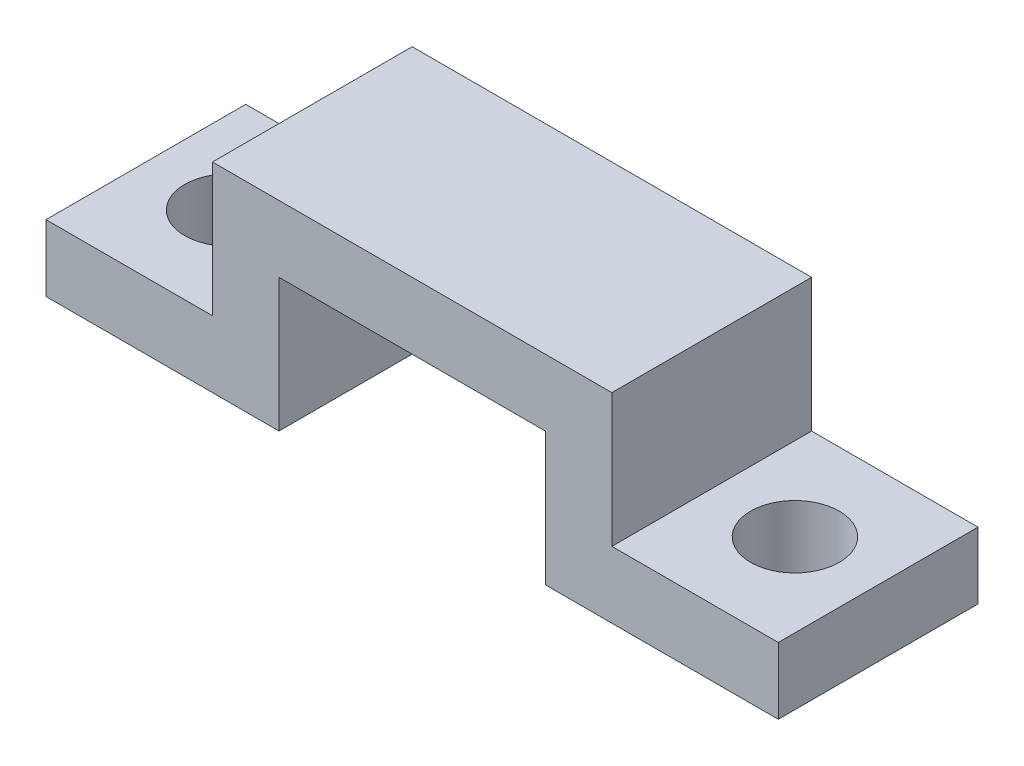
ISO-10303-21;
HEADER;
FILE_DESCRIPTION(('STEP AP214'),'2;1');
FILE_NAME('part.step','',(''),(''),'','','');
FILE_SCHEMA(('AUTOMOTIVE_DESIGN { 1 0 10303 214 1 1 1 1 }'));
ENDSEC;
DATA;
#1=APPLICATION_CONTEXT('core data for automotive mechanical design processes');
#2=APPLICATION_PROTOCOL_DEFINITION('international standard','automotive_design',2000,#1);
#3=PRODUCT_CONTEXT('',#1,'mechanical');
#4=PRODUCT('Part','Part','',(#3));
#5=PRODUCT_RELATED_PRODUCT_CATEGORY('part','',(#4));
#6=PRODUCT_DEFINITION_FORMATION('','',#4);
#7=PRODUCT_DEFINITION_CONTEXT('part definition',#1,'design');
#8=PRODUCT_DEFINITION('design','',#6,#7);
#9=PRODUCT_DEFINITION_SHAPE('','',#8);
#10=(LENGTH_UNIT() NAMED_UNIT(*) SI_UNIT(.MILLI.,.METRE.));
#11=(NAMED_UNIT(*) PLANE_ANGLE_UNIT() SI_UNIT($,.RADIAN.));
#12=(NAMED_UNIT(*) SI_UNIT($,.STERADIAN.) SOLID_ANGLE_UNIT());
#13=UNCERTAINTY_MEASURE_WITH_UNIT(LENGTH_MEASURE(1.E-05),#10,'distance_accuracy_value','');
#14=(GEOMETRIC_REPRESENTATION_CONTEXT(3) GLOBAL_UNCERTAINTY_ASSIGNED_CONTEXT((#13)) GLOBAL_UNIT_ASSIGNED_CONTEXT((#10,
#11,#12)) REPRESENTATION_CONTEXT('',''));
#15=CARTESIAN_POINT('',(0.,0.,0.));
#16=DIRECTION('',(0.,0.,1.));
#17=DIRECTION('',(1.,0.,0.));
#18=AXIS2_PLACEMENT_3D('',#15,#16,#17);
#19=CARTESIAN_POINT('',(0.,3.,9.));
#20=DIRECTION('',(1.,0.,0.));
#21=DIRECTION('',(0.,1.,0.));
#22=AXIS2_PLACEMENT_3D('',#19,#20,#21);
#23=PLANE('',#22);
#24=DIRECTION('',(0.,-1.,0.));
#25=VECTOR('',#24,1.);
#26=CARTESIAN_POINT('',(0.,3.,0.));
#27=LINE('',#26,#25);
#28=CARTESIAN_POINT('',(0.,3.,0.));
#29=VERTEX_POINT('',#28);
#30=CARTESIAN_POINT('',(0.,0.,0.));
#31=VERTEX_POINT('',#30);
#32=EDGE_CURVE('E164',#29,#31,#27,.T.);
#33=ORIENTED_EDGE('',*,*,#32,.T.);
#34=DIRECTION('',(0.,0.,-1.));
#35=VECTOR('',#34,1.);
#36=CARTESIAN_POINT('',(0.,0.,9.));
#37=LINE('',#36,#35);
#38=CARTESIAN_POINT('',(0.,0.,9.));
#39=VERTEX_POINT('',#38);
#40=EDGE_CURVE('E11',#39,#31,#37,.T.);
#41=ORIENTED_EDGE('',*,*,#40,.F.);
#42=DIRECTION('',(0.,-1.,0.));
#43=VECTOR('',#42,1.);
#44=CARTESIAN_POINT('',(0.,3.,9.));
#45=LINE('',#44,#43);
#46=CARTESIAN_POINT('',(0.,3.,9.));
#47=VERTEX_POINT('',#46);
#48=EDGE_CURVE('E199',#47,#39,#45,.T.);
#49=ORIENTED_EDGE('',*,*,#48,.F.);
#50=DIRECTION('',(0.,0.,-1.));
#51=VECTOR('',#50,1.);
#52=CARTESIAN_POINT('',(0.,3.,9.));
#53=LINE('',#52,#51);
#54=EDGE_CURVE('E160',#47,#29,#53,.T.);
#55=ORIENTED_EDGE('',*,*,#54,.T.);
#56=EDGE_LOOP('',(#33,#41,#49,#55));
#57=FACE_BOUND('',#56,.T.);
#58=ADVANCED_FACE('F39',(#57),#23,.F.);
#59=CARTESIAN_POINT('',(0.,0.,9.));
#60=DIRECTION('',(0.,1.,0.));
#61=DIRECTION('',(0.,0.,1.));
#62=AXIS2_PLACEMENT_3D('',#59,#60,#61);
#63=PLANE('',#62);
#64=CARTESIAN_POINT('',(3.75,0.,4.5));
#65=DIRECTION('',(0.,1.,0.));
#66=DIRECTION('',(0.,0.,1.));
#67=AXIS2_PLACEMENT_3D('',#64,#65,#66);
#68=CIRCLE('',#67,2.);
#69=CARTESIAN_POINT('',(3.75,0.,6.5));
#70=VERTEX_POINT('',#69);
#71=EDGE_CURVE('E401',#70,#70,#68,.T.);
#72=ORIENTED_EDGE('',*,*,#71,.T.);
#73=EDGE_LOOP('',(#72));
#74=FACE_BOUND('',#73,.T.);
#75=DIRECTION('',(1.,0.,0.));
#76=VECTOR('',#75,1.);
#77=CARTESIAN_POINT('',(0.,0.,0.));
#78=LINE('',#77,#76);
#79=CARTESIAN_POINT('',(10.5,0.,0.));
#80=VERTEX_POINT('',#79);
#81=EDGE_CURVE('E168',#31,#80,#78,.T.);
#82=ORIENTED_EDGE('',*,*,#81,.T.);
#83=DIRECTION('',(0.,0.,-1.));
#84=VECTOR('',#83,1.);
#85=CARTESIAN_POINT('',(10.5,0.,9.));
#86=LINE('',#85,#84);
#87=CARTESIAN_POINT('',(10.5,0.,9.));
#88=VERTEX_POINT('',#87);
#89=EDGE_CURVE('E48',#88,#80,#86,.T.);
#90=ORIENTED_EDGE('',*,*,#89,.F.);
#91=DIRECTION('',(1.,0.,0.));
#92=VECTOR('',#91,1.);
#93=CARTESIAN_POINT('',(0.,0.,9.));
#94=LINE('',#93,#92);
#95=EDGE_CURVE('E111',#39,#88,#94,.T.);
#96=ORIENTED_EDGE('',*,*,#95,.F.);
#97=ORIENTED_EDGE('',*,*,#40,.T.);
#98=EDGE_LOOP('',(#82,#90,#96,#97));
#99=FACE_BOUND('',#98,.T.);
#100=ADVANCED_FACE('F295',(#74,#99),#63,.F.);
#101=CARTESIAN_POINT('',(10.5,0.,9.));
#102=DIRECTION('',(-1.,0.,0.));
#103=DIRECTION('',(0.,0.,1.));
#104=AXIS2_PLACEMENT_3D('',#101,#102,#103);
#105=PLANE('',#104);
#106=DIRECTION('',(0.,1.,0.));
#107=VECTOR('',#106,1.);
#108=CARTESIAN_POINT('',(10.5,0.,0.));
#109=LINE('',#108,#107);
#110=CARTESIAN_POINT('',(10.5,6.,0.));
#111=VERTEX_POINT('',#110);
#112=EDGE_CURVE('E172',#80,#111,#109,.T.);
#113=ORIENTED_EDGE('',*,*,#112,.T.);
#114=DIRECTION('',(0.,0.,-1.));
#115=VECTOR('',#114,1.);
#116=CARTESIAN_POINT('',(10.5,6.,9.));
#117=LINE('',#116,#115);
#118=CARTESIAN_POINT('',(10.5,6.,9.));
#119=VERTEX_POINT('',#118);
#120=EDGE_CURVE('E226',#119,#111,#117,.T.);
#121=ORIENTED_EDGE('',*,*,#120,.F.);
#122=DIRECTION('',(0.,1.,0.));
#123=VECTOR('',#122,1.);
#124=CARTESIAN_POINT('',(10.5,0.,9.));
#125=LINE('',#124,#123);
#126=EDGE_CURVE('E236',#88,#119,#125,.T.);
#127=ORIENTED_EDGE('',*,*,#126,.F.);
#128=ORIENTED_EDGE('',*,*,#89,.T.);
#129=EDGE_LOOP('',(#113,#121,#127,#128));
#130=FACE_BOUND('',#129,.T.);
#131=ADVANCED_FACE('F234',(#130),#105,.F.);
#132=CARTESIAN_POINT('',(10.5,6.,9.));
#133=DIRECTION('',(0.,1.,0.));
#134=DIRECTION('',(-1.,0.,0.));
#135=AXIS2_PLACEMENT_3D('',#132,#133,#134);
#136=PLANE('',#135);
#137=DIRECTION('',(1.,0.,0.));
#138=VECTOR('',#137,1.);
#139=CARTESIAN_POINT('',(10.5,6.,0.));
#140=LINE('',#139,#138);
#141=CARTESIAN_POINT('',(22.5,6.,0.));
#142=VERTEX_POINT('',#141);
#143=EDGE_CURVE('E175',#111,#142,#140,.T.);
#144=ORIENTED_EDGE('',*,*,#143,.T.);
#145=DIRECTION('',(0.,0.,-1.));
#146=VECTOR('',#145,1.);
#147=CARTESIAN_POINT('',(22.5,6.,9.));
#148=LINE('',#147,#146);
#149=CARTESIAN_POINT('',(22.5,6.,9.));
#150=VERTEX_POINT('',#149);
#151=EDGE_CURVE('E222',#150,#142,#148,.T.);
#152=ORIENTED_EDGE('',*,*,#151,.F.);
#153=DIRECTION('',(1.,0.,0.));
#154=VECTOR('',#153,1.);
#155=CARTESIAN_POINT('',(10.5,6.,9.));
#156=LINE('',#155,#154);
#157=EDGE_CURVE('E255',#119,#150,#156,.T.);
#158=ORIENTED_EDGE('',*,*,#157,.F.);
#159=ORIENTED_EDGE('',*,*,#120,.T.);
#160=EDGE_LOOP('',(#144,#152,#158,#159));
#161=FACE_BOUND('',#160,.T.);
#162=ADVANCED_FACE('F245',(#161),#136,.F.);
#163=CARTESIAN_POINT('',(22.5,6.,9.));
#164=DIRECTION('',(1.,0.,0.));
#165=DIRECTION('',(0.,0.,-1.));
#166=AXIS2_PLACEMENT_3D('',#163,#164,#165);
#167=PLANE('',#166);
#168=DIRECTION('',(0.,-1.,0.));
#169=VECTOR('',#168,1.);
#170=CARTESIAN_POINT('',(22.5,6.,0.));
#171=LINE('',#170,#169);
#172=CARTESIAN_POINT('',(22.5,0.,0.));
#173=VERTEX_POINT('',#172);
#174=EDGE_CURVE('E178',#142,#173,#171,.T.);
#175=ORIENTED_EDGE('',*,*,#174,.T.);
#176=DIRECTION('',(0.,0.,-1.));
#177=VECTOR('',#176,1.);
#178=CARTESIAN_POINT('',(22.5,0.,9.));
#179=LINE('',#178,#177);
#180=CARTESIAN_POINT('',(22.5,0.,9.));
#181=VERTEX_POINT('',#180);
#182=EDGE_CURVE('E218',#181,#173,#179,.T.);
#183=ORIENTED_EDGE('',*,*,#182,.F.);
#184=DIRECTION('',(0.,-1.,0.));
#185=VECTOR('',#184,1.);
#186=CARTESIAN_POINT('',(22.5,6.,9.));
#187=LINE('',#186,#185);
#188=EDGE_CURVE('E251',#150,#181,#187,.T.);
#189=ORIENTED_EDGE('',*,*,#188,.F.);
#190=ORIENTED_EDGE('',*,*,#151,.T.);
#191=EDGE_LOOP('',(#175,#183,#189,#190));
#192=FACE_BOUND('',#191,.T.);
#193=ADVANCED_FACE('F249',(#192),#167,.F.);
#194=CARTESIAN_POINT('',(22.5,0.,9.));
#195=DIRECTION('',(0.,1.,0.));
#196=DIRECTION('',(-1.,0.,0.));
#197=AXIS2_PLACEMENT_3D('',#194,#195,#196);
#198=PLANE('',#197);
#199=CARTESIAN_POINT('',(29.25,0.,4.5));
#200=DIRECTION('',(0.,1.,0.));
#201=DIRECTION('',(-1.,0.,0.));
#202=AXIS2_PLACEMENT_3D('',#199,#200,#201);
#203=CIRCLE('',#202,2.);
#204=CARTESIAN_POINT('',(27.25,0.,4.5));
#205=VERTEX_POINT('',#204);
#206=EDGE_CURVE('E169',#205,#205,#203,.T.);
#207=ORIENTED_EDGE('',*,*,#206,.T.);
#208=EDGE_LOOP('',(#207));
#209=FACE_BOUND('',#208,.T.);
#210=DIRECTION('',(1.,0.,0.));
#211=VECTOR('',#210,1.);
#212=CARTESIAN_POINT('',(22.5,0.,0.));
#213=LINE('',#212,#211);
#214=CARTESIAN_POINT('',(33.,0.,0.));
#215=VERTEX_POINT('',#214);
#216=EDGE_CURVE('E181',#173,#215,#213,.T.);
#217=ORIENTED_EDGE('',*,*,#216,.T.);
#218=DIRECTION('',(0.,0.,-1.));
#219=VECTOR('',#218,1.);
#220=CARTESIAN_POINT('',(33.,0.,9.));
#221=LINE('',#220,#219);
#222=CARTESIAN_POINT('',(33.,0.,9.));
#223=VERTEX_POINT('',#222);
#224=EDGE_CURVE('E214',#223,#215,#221,.T.);
#225=ORIENTED_EDGE('',*,*,#224,.F.);
#226=DIRECTION('',(1.,0.,0.));
#227=VECTOR('',#226,1.);
#228=CARTESIAN_POINT('',(22.5,0.,9.));
#229=LINE('',#228,#227);
#230=EDGE_CURVE('E254',#181,#223,#229,.T.);
#231=ORIENTED_EDGE('',*,*,#230,.F.);
#232=ORIENTED_EDGE('',*,*,#182,.T.);
#233=EDGE_LOOP('',(#217,#225,#231,#232));
#234=FACE_BOUND('',#233,.T.);
#235=ADVANCED_FACE('F310',(#209,#234),#198,.F.);
#236=CARTESIAN_POINT('',(33.,0.,9.));
#237=DIRECTION('',(-1.,0.,0.));
#238=DIRECTION('',(0.,0.,1.));
#239=AXIS2_PLACEMENT_3D('',#236,#237,#238);
#240=PLANE('',#239);
#241=DIRECTION('',(0.,1.,0.));
#242=VECTOR('',#241,1.);
#243=CARTESIAN_POINT('',(33.,0.,0.));
#244=LINE('',#243,#242);
#245=CARTESIAN_POINT('',(33.,3.,0.));
#246=VERTEX_POINT('',#245);
#247=EDGE_CURVE('E184',#215,#246,#244,.T.);
#248=ORIENTED_EDGE('',*,*,#247,.T.);
#249=DIRECTION('',(0.,0.,-1.));
#250=VECTOR('',#249,1.);
#251=CARTESIAN_POINT('',(33.,3.,9.));
#252=LINE('',#251,#250);
#253=CARTESIAN_POINT('',(33.,3.,9.));
#254=VERTEX_POINT('',#253);
#255=EDGE_CURVE('E210',#254,#246,#252,.T.);
#256=ORIENTED_EDGE('',*,*,#255,.F.);
#257=DIRECTION('',(0.,1.,0.));
#258=VECTOR('',#257,1.);
#259=CARTESIAN_POINT('',(33.,0.,9.));
#260=LINE('',#259,#258);
#261=EDGE_CURVE('E259',#223,#254,#260,.T.);
#262=ORIENTED_EDGE('',*,*,#261,.F.);
#263=ORIENTED_EDGE('',*,*,#224,.T.);
#264=EDGE_LOOP('',(#248,#256,#262,#263));
#265=FACE_BOUND('',#264,.T.);
#266=ADVANCED_FACE('F313',(#265),#240,.F.);
#267=CARTESIAN_POINT('',(33.,3.,9.));
#268=DIRECTION('',(0.,-1.,0.));
#269=DIRECTION('',(1.,0.,0.));
#270=AXIS2_PLACEMENT_3D('',#267,#268,#269);
#271=PLANE('',#270);
#272=CARTESIAN_POINT('',(29.25,3.,4.5));
#273=DIRECTION('',(0.,1.,0.));
#274=DIRECTION('',(-1.,0.,0.));
#275=AXIS2_PLACEMENT_3D('',#272,#273,#274);
#276=CIRCLE('',#275,2.);
#277=CARTESIAN_POINT('',(27.25,3.,4.5));
#278=VERTEX_POINT('',#277);
#279=EDGE_CURVE('E397',#278,#278,#276,.T.);
#280=ORIENTED_EDGE('',*,*,#279,.F.);
#281=EDGE_LOOP('',(#280));
#282=FACE_BOUND('',#281,.T.);
#283=DIRECTION('',(-1.,0.,0.));
#284=VECTOR('',#283,1.);
#285=CARTESIAN_POINT('',(33.,3.,0.));
#286=LINE('',#285,#284);
#287=CARTESIAN_POINT('',(25.5,3.,0.));
#288=VERTEX_POINT('',#287);
#289=EDGE_CURVE('E187',#246,#288,#286,.T.);
#290=ORIENTED_EDGE('',*,*,#289,.T.);
#291=DIRECTION('',(0.,0.,-1.));
#292=VECTOR('',#291,1.);
#293=CARTESIAN_POINT('',(25.5,3.,9.));
#294=LINE('',#293,#292);
#295=CARTESIAN_POINT('',(25.5,3.,9.));
#296=VERTEX_POINT('',#295);
#297=EDGE_CURVE('E206',#296,#288,#294,.T.);
#298=ORIENTED_EDGE('',*,*,#297,.F.);
#299=DIRECTION('',(-1.,0.,0.));
#300=VECTOR('',#299,1.);
#301=CARTESIAN_POINT('',(33.,3.,9.));
#302=LINE('',#301,#300);
#303=EDGE_CURVE('E266',#254,#296,#302,.T.);
#304=ORIENTED_EDGE('',*,*,#303,.F.);
#305=ORIENTED_EDGE('',*,*,#255,.T.);
#306=EDGE_LOOP('',(#290,#298,#304,#305));
#307=FACE_BOUND('',#306,.T.);
#308=ADVANCED_FACE('F274',(#282,#307),#271,.F.);
#309=CARTESIAN_POINT('',(25.5,3.,9.));
#310=DIRECTION('',(-1.,0.,0.));
#311=DIRECTION('',(0.,0.,1.));
#312=AXIS2_PLACEMENT_3D('',#309,#310,#311);
#313=PLANE('',#312);
#314=DIRECTION('',(0.,1.,0.));
#315=VECTOR('',#314,1.);
#316=CARTESIAN_POINT('',(25.5,3.,0.));
#317=LINE('',#316,#315);
#318=CARTESIAN_POINT('',(25.5,9.,0.));
#319=VERTEX_POINT('',#318);
#320=EDGE_CURVE('E190',#288,#319,#317,.T.);
#321=ORIENTED_EDGE('',*,*,#320,.T.);
#322=DIRECTION('',(0.,0.,-1.));
#323=VECTOR('',#322,1.);
#324=CARTESIAN_POINT('',(25.5,9.,9.));
#325=LINE('',#324,#323);
#326=CARTESIAN_POINT('',(25.5,9.,9.));
#327=VERTEX_POINT('',#326);
#328=EDGE_CURVE('E153',#327,#319,#325,.T.);
#329=ORIENTED_EDGE('',*,*,#328,.F.);
#330=DIRECTION('',(0.,1.,0.));
#331=VECTOR('',#330,1.);
#332=CARTESIAN_POINT('',(25.5,3.,9.));
#333=LINE('',#332,#331);
#334=EDGE_CURVE('E142',#296,#327,#333,.T.);
#335=ORIENTED_EDGE('',*,*,#334,.F.);
#336=ORIENTED_EDGE('',*,*,#297,.T.);
#337=EDGE_LOOP('',(#321,#329,#335,#336));
#338=FACE_BOUND('',#337,.T.);
#339=ADVANCED_FACE('F278',(#338),#313,.F.);
#340=CARTESIAN_POINT('',(25.5,9.,9.));
#341=DIRECTION('',(0.,-1.,0.));
#342=DIRECTION('',(1.,0.,0.));
#343=AXIS2_PLACEMENT_3D('',#340,#341,#342);
#344=PLANE('',#343);
#345=DIRECTION('',(-1.,0.,0.));
#346=VECTOR('',#345,1.);
#347=CARTESIAN_POINT('',(25.5,9.,0.));
#348=LINE('',#347,#346);
#349=CARTESIAN_POINT('',(7.5,9.,0.));
#350=VERTEX_POINT('',#349);
#351=EDGE_CURVE('E151',#319,#350,#348,.T.);
#352=ORIENTED_EDGE('',*,*,#351,.T.);
#353=DIRECTION('',(0.,0.,-1.));
#354=VECTOR('',#353,1.);
#355=CARTESIAN_POINT('',(7.5,9.,9.));
#356=LINE('',#355,#354);
#357=CARTESIAN_POINT('',(7.5,9.,9.));
#358=VERTEX_POINT('',#357);
#359=EDGE_CURVE('E148',#358,#350,#356,.T.);
#360=ORIENTED_EDGE('',*,*,#359,.F.);
#361=DIRECTION('',(-1.,0.,0.));
#362=VECTOR('',#361,1.);
#363=CARTESIAN_POINT('',(25.5,9.,9.));
#364=LINE('',#363,#362);
#365=EDGE_CURVE('E136',#327,#358,#364,.T.);
#366=ORIENTED_EDGE('',*,*,#365,.F.);
#367=ORIENTED_EDGE('',*,*,#328,.T.);
#368=EDGE_LOOP('',(#352,#360,#366,#367));
#369=FACE_BOUND('',#368,.T.);
#370=ADVANCED_FACE('F149',(#369),#344,.F.);
#371=CARTESIAN_POINT('',(7.5,9.,9.));
#372=DIRECTION('',(1.,0.,0.));
#373=DIRECTION('',(0.,1.,0.));
#374=AXIS2_PLACEMENT_3D('',#371,#372,#373);
#375=PLANE('',#374);
#376=DIRECTION('',(0.,-1.,0.));
#377=VECTOR('',#376,1.);
#378=CARTESIAN_POINT('',(7.5,9.,0.));
#379=LINE('',#378,#377);
#380=CARTESIAN_POINT('',(7.5,3.,0.));
#381=VERTEX_POINT('',#380);
#382=EDGE_CURVE('E97',#350,#381,#379,.T.);
#383=ORIENTED_EDGE('',*,*,#382,.T.);
#384=DIRECTION('',(0.,0.,-1.));
#385=VECTOR('',#384,1.);
#386=CARTESIAN_POINT('',(7.5,3.,9.));
#387=LINE('',#386,#385);
#388=CARTESIAN_POINT('',(7.5,3.,9.));
#389=VERTEX_POINT('',#388);
#390=EDGE_CURVE('E154',#389,#381,#387,.T.);
#391=ORIENTED_EDGE('',*,*,#390,.F.);
#392=DIRECTION('',(0.,-1.,0.));
#393=VECTOR('',#392,1.);
#394=CARTESIAN_POINT('',(7.5,9.,9.));
#395=LINE('',#394,#393);
#396=EDGE_CURVE('E140',#358,#389,#395,.T.);
#397=ORIENTED_EDGE('',*,*,#396,.F.);
#398=ORIENTED_EDGE('',*,*,#359,.T.);
#399=EDGE_LOOP('',(#383,#391,#397,#398));
#400=FACE_BOUND('',#399,.T.);
#401=ADVANCED_FACE('F156',(#400),#375,.F.);
#402=CARTESIAN_POINT('',(7.5,3.,9.));
#403=DIRECTION('',(0.,-1.,0.));
#404=DIRECTION('',(1.,0.,0.));
#405=AXIS2_PLACEMENT_3D('',#402,#403,#404);
#406=PLANE('',#405);
#407=CARTESIAN_POINT('',(3.75,3.,4.5));
#408=DIRECTION('',(0.,1.,0.));
#409=DIRECTION('',(-1.,0.,0.));
#410=AXIS2_PLACEMENT_3D('',#407,#408,#409);
#411=CIRCLE('',#410,2.);
#412=CARTESIAN_POINT('',(1.75,3.,4.5));
#413=VERTEX_POINT('',#412);
#414=EDGE_CURVE('E411',#413,#413,#411,.T.);
#415=ORIENTED_EDGE('',*,*,#414,.F.);
#416=EDGE_LOOP('',(#415));
#417=FACE_BOUND('',#416,.T.);
#418=DIRECTION('',(-1.,0.,0.));
#419=VECTOR('',#418,1.);
#420=CARTESIAN_POINT('',(7.5,3.,0.));
#421=LINE('',#420,#419);
#422=EDGE_CURVE('E103',#381,#29,#421,.T.);
#423=ORIENTED_EDGE('',*,*,#422,.T.);
#424=ORIENTED_EDGE('',*,*,#54,.F.);
#425=DIRECTION('',(-1.,0.,0.));
#426=VECTOR('',#425,1.);
#427=CARTESIAN_POINT('',(7.5,3.,9.));
#428=LINE('',#427,#426);
#429=EDGE_CURVE('E56',#389,#47,#428,.T.);
#430=ORIENTED_EDGE('',*,*,#429,.F.);
#431=ORIENTED_EDGE('',*,*,#390,.T.);
#432=EDGE_LOOP('',(#423,#424,#430,#431));
#433=FACE_BOUND('',#432,.T.);
#434=ADVANCED_FACE('F282',(#417,#433),#406,.F.);
#435=CARTESIAN_POINT('',(0.,0.,9.));
#436=DIRECTION('',(0.,0.,1.));
#437=DIRECTION('',(1.,0.,0.));
#438=AXIS2_PLACEMENT_3D('',#435,#436,#437);
#439=PLANE('',#438);
#440=ORIENTED_EDGE('',*,*,#48,.T.);
#441=ORIENTED_EDGE('',*,*,#95,.T.);
#442=ORIENTED_EDGE('',*,*,#126,.T.);
#443=ORIENTED_EDGE('',*,*,#157,.T.);
#444=ORIENTED_EDGE('',*,*,#188,.T.);
#445=ORIENTED_EDGE('',*,*,#230,.T.);
#446=ORIENTED_EDGE('',*,*,#261,.T.);
#447=ORIENTED_EDGE('',*,*,#303,.T.);
#448=ORIENTED_EDGE('',*,*,#334,.T.);
#449=ORIENTED_EDGE('',*,*,#365,.T.);
#450=ORIENTED_EDGE('',*,*,#396,.T.);
#451=ORIENTED_EDGE('',*,*,#429,.T.);
#452=EDGE_LOOP('',(#440,#441,#442,#443,#444,#445,#446,#447,#448,#449,#450,#451));
#453=FACE_BOUND('',#452,.T.);
#454=ADVANCED_FACE('F138',(#453),#439,.T.);
#455=CARTESIAN_POINT('',(0.,0.,0.));
#456=DIRECTION('',(0.,0.,1.));
#457=DIRECTION('',(1.,0.,0.));
#458=AXIS2_PLACEMENT_3D('',#455,#456,#457);
#459=PLANE('',#458);
#460=ORIENTED_EDGE('',*,*,#32,.F.);
#461=ORIENTED_EDGE('',*,*,#422,.F.);
#462=ORIENTED_EDGE('',*,*,#382,.F.);
#463=ORIENTED_EDGE('',*,*,#351,.F.);
#464=ORIENTED_EDGE('',*,*,#320,.F.);
#465=ORIENTED_EDGE('',*,*,#289,.F.);
#466=ORIENTED_EDGE('',*,*,#247,.F.);
#467=ORIENTED_EDGE('',*,*,#216,.F.);
#468=ORIENTED_EDGE('',*,*,#174,.F.);
#469=ORIENTED_EDGE('',*,*,#143,.F.);
#470=ORIENTED_EDGE('',*,*,#112,.F.);
#471=ORIENTED_EDGE('',*,*,#81,.F.);
#472=EDGE_LOOP('',(#460,#461,#462,#463,#464,#465,#466,#467,#468,#469,#470,#471));
#473=FACE_BOUND('',#472,.T.);
#474=ADVANCED_FACE('F240',(#473),#459,.F.);
#475=CARTESIAN_POINT('',(3.75,-7.,4.5));
#476=DIRECTION('',(0.,1.,0.));
#477=DIRECTION('',(-1.,0.,0.));
#478=AXIS2_PLACEMENT_3D('',#475,#476,#477);
#479=CYLINDRICAL_SURFACE('',#478,2.);
#480=ORIENTED_EDGE('',*,*,#414,.T.);
#481=EDGE_LOOP('',(#480));
#482=FACE_BOUND('',#481,.T.);
#483=ORIENTED_EDGE('',*,*,#71,.F.);
#484=EDGE_LOOP('',(#483));
#485=FACE_BOUND('',#484,.T.);
#486=ADVANCED_FACE('F347',(#482,#485),#479,.F.);
#487=CARTESIAN_POINT('',(29.25,-7.,4.5));
#488=DIRECTION('',(0.,1.,0.));
#489=DIRECTION('',(-1.,0.,0.));
#490=AXIS2_PLACEMENT_3D('',#487,#488,#489);
#491=CYLINDRICAL_SURFACE('',#490,2.);
#492=ORIENTED_EDGE('',*,*,#279,.T.);
#493=EDGE_LOOP('',(#492));
#494=FACE_BOUND('',#493,.T.);
#495=ORIENTED_EDGE('',*,*,#206,.F.);
#496=EDGE_LOOP('',(#495));
#497=FACE_BOUND('',#496,.T.);
#498=ADVANCED_FACE('F380',(#494,#497),#491,.F.);
#499=CLOSED_SHELL('',(#58,#100,#131,#162,#193,#235,#266,#308,#339,#370,#401,#434,#454,#474,#486,#498));
#500=MANIFOLD_SOLID_BREP('B2',#499);
#501=ADVANCED_BREP_SHAPE_REPRESENTATION('',(#18,#500),#14);
#502=SHAPE_DEFINITION_REPRESENTATION(#9,#501);
ENDSEC;
END-ISO-10303-21;
